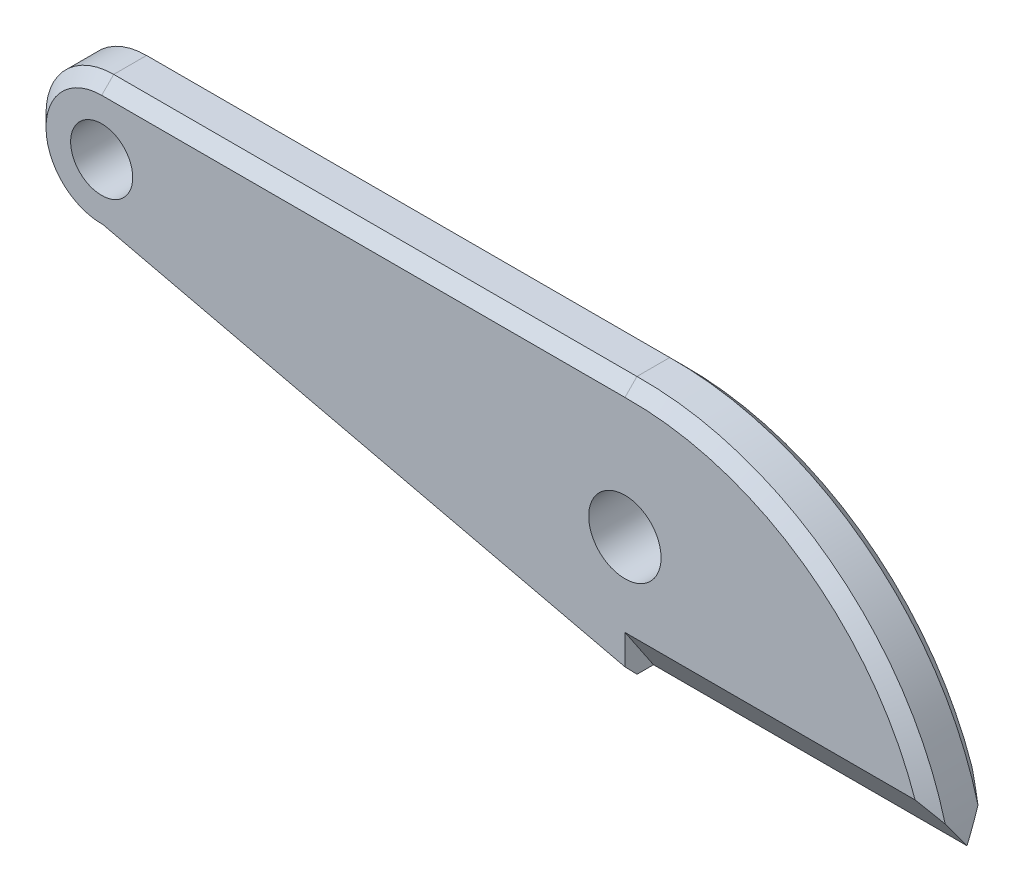
ISO-10303-21;
HEADER;
FILE_DESCRIPTION(('STEP AP214'),'2;1');
FILE_NAME('part.step','',(''),(''),'','','');
FILE_SCHEMA(('AUTOMOTIVE_DESIGN { 1 0 10303 214 1 1 1 1 }'));
ENDSEC;
DATA;
#1=APPLICATION_CONTEXT('core data for automotive mechanical design processes');
#2=APPLICATION_PROTOCOL_DEFINITION('international standard','automotive_design',2000,#1);
#3=PRODUCT_CONTEXT('',#1,'mechanical');
#4=PRODUCT('Part','Part','',(#3));
#5=PRODUCT_RELATED_PRODUCT_CATEGORY('part','',(#4));
#6=PRODUCT_DEFINITION_FORMATION('','',#4);
#7=PRODUCT_DEFINITION_CONTEXT('part definition',#1,'design');
#8=PRODUCT_DEFINITION('design','',#6,#7);
#9=PRODUCT_DEFINITION_SHAPE('','',#8);
#10=(LENGTH_UNIT() NAMED_UNIT(*) SI_UNIT(.MILLI.,.METRE.));
#11=(NAMED_UNIT(*) PLANE_ANGLE_UNIT() SI_UNIT($,.RADIAN.));
#12=(NAMED_UNIT(*) SI_UNIT($,.STERADIAN.) SOLID_ANGLE_UNIT());
#13=UNCERTAINTY_MEASURE_WITH_UNIT(LENGTH_MEASURE(1.E-05),#10,'distance_accuracy_value','');
#14=(GEOMETRIC_REPRESENTATION_CONTEXT(3) GLOBAL_UNCERTAINTY_ASSIGNED_CONTEXT((#13)) GLOBAL_UNIT_ASSIGNED_CONTEXT((#10,
#11,#12)) REPRESENTATION_CONTEXT('',''));
#15=CARTESIAN_POINT('',(0.,0.,0.));
#16=DIRECTION('',(0.,0.,1.));
#17=DIRECTION('',(1.,0.,0.));
#18=AXIS2_PLACEMENT_3D('',#15,#16,#17);
#19=CARTESIAN_POINT('',(0.,0.,9.44));
#20=DIRECTION('',(0.,0.,1.));
#21=DIRECTION('',(1.,0.,0.));
#22=AXIS2_PLACEMENT_3D('',#19,#20,#21);
#23=PLANE('',#22);
#24=CARTESIAN_POINT('',(0.,0.,9.44));
#25=DIRECTION('',(0.,0.,1.));
#26=DIRECTION('',(1.,0.,0.));
#27=AXIS2_PLACEMENT_3D('',#24,#25,#26);
#28=CIRCLE('',#27,5.15);
#29=CARTESIAN_POINT('',(5.15,0.,9.44));
#30=VERTEX_POINT('',#29);
#31=EDGE_CURVE('E214',#30,#30,#28,.T.);
#32=ORIENTED_EDGE('',*,*,#31,.F.);
#33=EDGE_LOOP('',(#32));
#34=FACE_BOUND('',#33,.T.);
#35=CARTESIAN_POINT('',(86.74,-10.81,9.44));
#36=DIRECTION('',(0.,0.,1.));
#37=DIRECTION('',(1.,0.,0.));
#38=AXIS2_PLACEMENT_3D('',#35,#36,#37);
#39=CIRCLE('',#38,6.);
#40=CARTESIAN_POINT('',(92.74,-10.81,9.44));
#41=VERTEX_POINT('',#40);
#42=EDGE_CURVE('E206',#41,#41,#39,.T.);
#43=ORIENTED_EDGE('',*,*,#42,.F.);
#44=EDGE_LOOP('',(#43));
#45=FACE_BOUND('',#44,.T.);
#46=DIRECTION('',(-1.,0.,0.));
#47=VECTOR('',#46,1.);
#48=CARTESIAN_POINT('',(0.,9.23,9.44));
#49=LINE('',#48,#47);
#50=CARTESIAN_POINT('',(86.7561179139094,9.23,9.44));
#51=VERTEX_POINT('',#50);
#52=CARTESIAN_POINT('',(0.,9.23,9.44));
#53=VERTEX_POINT('',#52);
#54=EDGE_CURVE('E264',#51,#53,#49,.T.);
#55=ORIENTED_EDGE('',*,*,#54,.T.);
#56=CARTESIAN_POINT('',(0.,0.,9.44));
#57=DIRECTION('',(0.,0.,1.));
#58=DIRECTION('',(1.,0.,0.));
#59=AXIS2_PLACEMENT_3D('',#56,#57,#58);
#60=CIRCLE('',#59,9.22999999999999);
#61=CARTESIAN_POINT('',(0.219524262516146,-9.22738907265575,9.44));
#62=VERTEX_POINT('',#61);
#63=EDGE_CURVE('E332',#53,#62,#60,.T.);
#64=ORIENTED_EDGE('',*,*,#63,.T.);
#65=DIRECTION('',(0.97374009165699,-0.227662543910581,0.));
#66=VECTOR('',#65,1.);
#67=CARTESIAN_POINT('',(87.1953250878212,-29.562519816686,9.44));
#68=LINE('',#67,#66);
#69=CARTESIAN_POINT('',(86.7699401656885,-29.4630638999135,9.44));
#70=VERTEX_POINT('',#69);
#71=EDGE_CURVE('E77',#62,#70,#68,.T.);
#72=ORIENTED_EDGE('',*,*,#71,.T.);
#73=DIRECTION('',(0.,1.,0.));
#74=VECTOR('',#73,1.);
#75=CARTESIAN_POINT('',(86.7699401656885,0.,9.44));
#76=LINE('',#75,#74);
#77=CARTESIAN_POINT('',(86.7699401656885,-24.51,9.44));
#78=VERTEX_POINT('',#77);
#79=EDGE_CURVE('E149',#70,#78,#76,.T.);
#80=ORIENTED_EDGE('',*,*,#79,.T.);
#81=DIRECTION('',(1.,0.,0.));
#82=VECTOR('',#81,1.);
#83=CARTESIAN_POINT('',(86.7699401656885,-24.51,9.44));
#84=LINE('',#83,#82);
#85=CARTESIAN_POINT('',(134.854480477729,-24.51,9.44));
#86=VERTEX_POINT('',#85);
#87=EDGE_CURVE('E153',#78,#86,#84,.T.);
#88=ORIENTED_EDGE('',*,*,#87,.T.);
#89=CARTESIAN_POINT('',(87.5699401656885,-40.7633764947169,9.44));
#90=DIRECTION('',(0.,0.,1.));
#91=DIRECTION('',(1.,0.,0.));
#92=AXIS2_PLACEMENT_3D('',#89,#90,#91);
#93=CIRCLE('',#92,50.);
#94=EDGE_CURVE('E267',#86,#51,#93,.T.);
#95=ORIENTED_EDGE('',*,*,#94,.T.);
#96=EDGE_LOOP('',(#55,#64,#72,#80,#88,#95));
#97=FACE_BOUND('',#96,.T.);
#98=ADVANCED_FACE('F47',(#34,#45,#97),#23,.T.);
#99=CARTESIAN_POINT('',(138.74,-31.51,9.44));
#100=DIRECTION('',(0.,1.,0.));
#101=DIRECTION('',(-1.,0.,0.));
#102=AXIS2_PLACEMENT_3D('',#99,#100,#101);
#103=PLANE('',#102);
#104=DIRECTION('',(0.,0.,-1.));
#105=VECTOR('',#104,1.);
#106=CARTESIAN_POINT('',(86.74,-31.51,9.44));
#107=LINE('',#106,#105);
#108=CARTESIAN_POINT('',(86.74,-31.51,7.44));
#109=VERTEX_POINT('',#108);
#110=CARTESIAN_POINT('',(86.74,-31.51,2.00000000000003));
#111=VERTEX_POINT('',#110);
#112=EDGE_CURVE('E229',#109,#111,#107,.T.);
#113=ORIENTED_EDGE('',*,*,#112,.T.);
#114=DIRECTION('',(-0.975050647346864,0.,0.221982510816644));
#115=VECTOR('',#114,1.);
#116=CARTESIAN_POINT('',(86.74,-31.51,2.00000000000003));
#117=LINE('',#116,#115);
#118=CARTESIAN_POINT('',(86.7699401656885,-31.51,1.99318374571431));
#119=VERTEX_POINT('',#118);
#120=EDGE_CURVE('E340',#111,#119,#117,.F.);
#121=ORIENTED_EDGE('',*,*,#120,.T.);
#122=DIRECTION('',(0.,0.,-1.));
#123=VECTOR('',#122,1.);
#124=CARTESIAN_POINT('',(86.7699401656885,-31.51,0.));
#125=LINE('',#124,#123);
#126=CARTESIAN_POINT('',(86.7699401656885,-31.51,4.72));
#127=VERTEX_POINT('',#126);
#128=EDGE_CURVE('E194',#127,#119,#125,.T.);
#129=ORIENTED_EDGE('',*,*,#128,.F.);
#130=DIRECTION('',(0.,0.,1.));
#131=VECTOR('',#130,1.);
#132=CARTESIAN_POINT('',(86.7699401656885,-31.51,0.));
#133=LINE('',#132,#131);
#134=CARTESIAN_POINT('',(86.7699401656885,-31.51,7.44681625428573));
#135=VERTEX_POINT('',#134);
#136=EDGE_CURVE('E159',#127,#135,#133,.T.);
#137=ORIENTED_EDGE('',*,*,#136,.T.);
#138=DIRECTION('',(-0.975050647346864,0.,-0.221982510816645));
#139=VECTOR('',#138,1.);
#140=CARTESIAN_POINT('',(2.77315825911884,-31.51,-11.6761047948661));
#141=LINE('',#140,#139);
#142=EDGE_CURVE('E343',#135,#109,#141,.T.);
#143=ORIENTED_EDGE('',*,*,#142,.T.);
#144=EDGE_LOOP('',(#113,#121,#129,#137,#143));
#145=FACE_BOUND('',#144,.T.);
#146=ADVANCED_FACE('F488',(#145),#103,.F.);
#147=CARTESIAN_POINT('',(87.5699401656885,-40.7633764947169,9.44));
#148=DIRECTION('',(0.,0.,-1.));
#149=DIRECTION('',(-1.,0.,0.));
#150=AXIS2_PLACEMENT_3D('',#147,#148,#149);
#151=CYLINDRICAL_SURFACE('',#150,52.);
#152=CARTESIAN_POINT('',(87.5699401656885,-40.7633764947169,10.9594195792948));
#153=DIRECTION('',(0.,0.559065930846162,0.829123202526087));
#154=DIRECTION('',(0.,0.829123202526087,-0.559065930846162));
#155=AXIS2_PLACEMENT_3D('',#152,#153,#154);
#156=ELLIPSE('',#155,62.716855398054,52.);
#157=CARTESIAN_POINT('',(138.74,-31.51,4.72));
#158=VERTEX_POINT('',#157);
#159=CARTESIAN_POINT('',(137.84367414671,-27.4761016949153,2.));
#160=VERTEX_POINT('',#159);
#161=EDGE_CURVE('E237',#158,#160,#156,.T.);
#162=ORIENTED_EDGE('',*,*,#161,.T.);
#163=CARTESIAN_POINT('',(87.5699401656885,-40.7633764947169,1.99999999999997));
#164=DIRECTION('',(0.,0.,1.));
#165=DIRECTION('',(1.,0.,0.));
#166=AXIS2_PLACEMENT_3D('',#163,#164,#165);
#167=CIRCLE('',#166,52.);
#168=CARTESIAN_POINT('',(86.7400000000001,11.23,1.99999999999997));
#169=VERTEX_POINT('',#168);
#170=EDGE_CURVE('E244',#160,#169,#167,.T.);
#171=ORIENTED_EDGE('',*,*,#170,.T.);
#172=DIRECTION('',(0.,0.,-1.));
#173=VECTOR('',#172,1.);
#174=CARTESIAN_POINT('',(86.7400000000001,11.23,9.44));
#175=LINE('',#174,#173);
#176=CARTESIAN_POINT('',(86.7400000000001,11.23,7.44));
#177=VERTEX_POINT('',#176);
#178=EDGE_CURVE('E225',#177,#169,#175,.T.);
#179=ORIENTED_EDGE('',*,*,#178,.F.);
#180=CARTESIAN_POINT('',(87.5699401656885,-40.7633764947169,7.44));
#181=DIRECTION('',(0.,0.,1.));
#182=DIRECTION('',(1.,0.,0.));
#183=AXIS2_PLACEMENT_3D('',#180,#181,#182);
#184=CIRCLE('',#183,52.);
#185=CARTESIAN_POINT('',(137.84367414671,-27.4761016949153,7.44));
#186=VERTEX_POINT('',#185);
#187=EDGE_CURVE('E241',#177,#186,#184,.F.);
#188=ORIENTED_EDGE('',*,*,#187,.T.);
#189=CARTESIAN_POINT('',(87.5699401656885,-40.7633764947169,-1.5194195792948));
#190=DIRECTION('',(0.,-0.559065930846162,0.829123202526087));
#191=DIRECTION('',(0.,-0.829123202526087,-0.559065930846162));
#192=AXIS2_PLACEMENT_3D('',#189,#190,#191);
#193=ELLIPSE('',#192,62.716855398054,52.);
#194=EDGE_CURVE('E169',#158,#186,#193,.T.);
#195=ORIENTED_EDGE('',*,*,#194,.F.);
#196=EDGE_LOOP('',(#162,#171,#179,#188,#195));
#197=FACE_BOUND('',#196,.T.);
#198=ADVANCED_FACE('F476',(#197),#151,.T.);
#199=CARTESIAN_POINT('',(0.,0.,0.));
#200=DIRECTION('',(0.,0.,1.));
#201=DIRECTION('',(1.,0.,0.));
#202=AXIS2_PLACEMENT_3D('',#199,#200,#201);
#203=PLANE('',#202);
#204=DIRECTION('',(-0.97374009165699,0.227662543910581,0.));
#205=VECTOR('',#204,1.);
#206=CARTESIAN_POINT('',(-2.03418787596279,-8.70046628999082,0.));
#207=LINE('',#206,#205);
#208=CARTESIAN_POINT('',(86.7699401656885,-29.4630638999134,0.));
#209=VERTEX_POINT('',#208);
#210=CARTESIAN_POINT('',(0.219524262516174,-9.22738907265572,0.));
#211=VERTEX_POINT('',#210);
#212=EDGE_CURVE('E358',#209,#211,#207,.T.);
#213=ORIENTED_EDGE('',*,*,#212,.T.);
#214=CARTESIAN_POINT('',(0.,0.,0.));
#215=DIRECTION('',(0.,0.,1.));
#216=DIRECTION('',(1.,0.,0.));
#217=AXIS2_PLACEMENT_3D('',#214,#215,#216);
#218=CIRCLE('',#217,9.22999999999996);
#219=CARTESIAN_POINT('',(0.,9.23,0.));
#220=VERTEX_POINT('',#219);
#221=EDGE_CURVE('E355',#211,#220,#218,.F.);
#222=ORIENTED_EDGE('',*,*,#221,.T.);
#223=DIRECTION('',(1.,0.,0.));
#224=VECTOR('',#223,1.);
#225=CARTESIAN_POINT('',(0.,9.23,0.));
#226=LINE('',#225,#224);
#227=CARTESIAN_POINT('',(86.7561179139092,9.22999999999999,0.));
#228=VERTEX_POINT('',#227);
#229=EDGE_CURVE('E248',#220,#228,#226,.T.);
#230=ORIENTED_EDGE('',*,*,#229,.T.);
#231=CARTESIAN_POINT('',(87.5699401656885,-40.7633764947169,0.));
#232=DIRECTION('',(0.,0.,1.));
#233=DIRECTION('',(1.,0.,0.));
#234=AXIS2_PLACEMENT_3D('',#231,#232,#233);
#235=CIRCLE('',#234,50.);
#236=CARTESIAN_POINT('',(134.854480477729,-24.51,0.));
#237=VERTEX_POINT('',#236);
#238=EDGE_CURVE('E251',#228,#237,#235,.F.);
#239=ORIENTED_EDGE('',*,*,#238,.T.);
#240=DIRECTION('',(1.,0.,0.));
#241=VECTOR('',#240,1.);
#242=CARTESIAN_POINT('',(86.7699401656885,-24.51,0.));
#243=LINE('',#242,#241);
#244=CARTESIAN_POINT('',(86.7699401656885,-24.51,0.));
#245=VERTEX_POINT('',#244);
#246=EDGE_CURVE('E198',#245,#237,#243,.T.);
#247=ORIENTED_EDGE('',*,*,#246,.F.);
#248=DIRECTION('',(0.,1.,0.));
#249=VECTOR('',#248,1.);
#250=CARTESIAN_POINT('',(86.7699401656885,0.,0.));
#251=LINE('',#250,#249);
#252=EDGE_CURVE('E187',#209,#245,#251,.T.);
#253=ORIENTED_EDGE('',*,*,#252,.F.);
#254=EDGE_LOOP('',(#213,#222,#230,#239,#247,#253));
#255=FACE_BOUND('',#254,.T.);
#256=CARTESIAN_POINT('',(0.,0.,0.));
#257=DIRECTION('',(0.,0.,1.));
#258=DIRECTION('',(1.,0.,0.));
#259=AXIS2_PLACEMENT_3D('',#256,#257,#258);
#260=CIRCLE('',#259,5.15);
#261=CARTESIAN_POINT('',(5.15,0.,0.));
#262=VERTEX_POINT('',#261);
#263=EDGE_CURVE('E210',#262,#262,#260,.T.);
#264=ORIENTED_EDGE('',*,*,#263,.T.);
#265=EDGE_LOOP('',(#264));
#266=FACE_BOUND('',#265,.T.);
#267=CARTESIAN_POINT('',(86.74,-10.81,0.));
#268=DIRECTION('',(0.,0.,1.));
#269=DIRECTION('',(1.,0.,0.));
#270=AXIS2_PLACEMENT_3D('',#267,#268,#269);
#271=CIRCLE('',#270,6.);
#272=CARTESIAN_POINT('',(92.74,-10.81,0.));
#273=VERTEX_POINT('',#272);
#274=EDGE_CURVE('E202',#273,#273,#271,.T.);
#275=ORIENTED_EDGE('',*,*,#274,.T.);
#276=EDGE_LOOP('',(#275));
#277=FACE_BOUND('',#276,.T.);
#278=ADVANCED_FACE('F497',(#255,#266,#277),#203,.F.);
#279=CARTESIAN_POINT('',(0.,0.,9.44));
#280=DIRECTION('',(0.,0.,-1.));
#281=DIRECTION('',(-1.,0.,0.));
#282=AXIS2_PLACEMENT_3D('',#279,#280,#281);
#283=CYLINDRICAL_SURFACE('',#282,11.23);
#284=DIRECTION('',(0.,0.,-1.));
#285=VECTOR('',#284,1.);
#286=CARTESIAN_POINT('',(0.,11.23,9.44));
#287=LINE('',#286,#285);
#288=CARTESIAN_POINT('',(0.,11.23,7.44));
#289=VERTEX_POINT('',#288);
#290=CARTESIAN_POINT('',(0.,11.23,1.99999999999997));
#291=VERTEX_POINT('',#290);
#292=EDGE_CURVE('E218',#289,#291,#287,.T.);
#293=ORIENTED_EDGE('',*,*,#292,.T.);
#294=CARTESIAN_POINT('',(0.,0.,2.00000000000003));
#295=DIRECTION('',(0.,0.,1.));
#296=DIRECTION('',(1.,0.,0.));
#297=AXIS2_PLACEMENT_3D('',#294,#295,#296);
#298=CIRCLE('',#297,11.23);
#299=CARTESIAN_POINT('',(0.,-11.23,2.00000000000003));
#300=VERTEX_POINT('',#299);
#301=EDGE_CURVE('E361',#291,#300,#298,.T.);
#302=ORIENTED_EDGE('',*,*,#301,.T.);
#303=DIRECTION('',(0.,0.,-1.));
#304=VECTOR('',#303,1.);
#305=CARTESIAN_POINT('',(0.,-11.23,9.44));
#306=LINE('',#305,#304);
#307=CARTESIAN_POINT('',(0.,-11.23,7.44));
#308=VERTEX_POINT('',#307);
#309=EDGE_CURVE('E233',#308,#300,#306,.T.);
#310=ORIENTED_EDGE('',*,*,#309,.F.);
#311=CARTESIAN_POINT('',(0.,0.,7.43999999999997));
#312=DIRECTION('',(0.,0.,1.));
#313=DIRECTION('',(1.,0.,0.));
#314=AXIS2_PLACEMENT_3D('',#311,#312,#313);
#315=CIRCLE('',#314,11.23);
#316=EDGE_CURVE('E271',#308,#289,#315,.F.);
#317=ORIENTED_EDGE('',*,*,#316,.T.);
#318=EDGE_LOOP('',(#293,#302,#310,#317));
#319=FACE_BOUND('',#318,.T.);
#320=ADVANCED_FACE('F370',(#319),#283,.T.);
#321=CARTESIAN_POINT('',(86.74,-31.51,9.44));
#322=DIRECTION('',(0.227662543910581,0.97374009165699,0.));
#323=DIRECTION('',(-0.97374009165699,0.227662543910581,0.));
#324=AXIS2_PLACEMENT_3D('',#321,#322,#323);
#325=PLANE('',#324);
#326=ORIENTED_EDGE('',*,*,#309,.T.);
#327=DIRECTION('',(0.97374009165699,-0.227662543910581,0.));
#328=VECTOR('',#327,1.);
#329=CARTESIAN_POINT('',(86.74,-31.51,2.00000000000003));
#330=LINE('',#329,#328);
#331=EDGE_CURVE('E346',#300,#111,#330,.T.);
#332=ORIENTED_EDGE('',*,*,#331,.T.);
#333=ORIENTED_EDGE('',*,*,#112,.F.);
#334=DIRECTION('',(-0.97374009165699,0.227662543910581,0.));
#335=VECTOR('',#334,1.);
#336=CARTESIAN_POINT('',(0.,-11.23,7.44));
#337=LINE('',#336,#335);
#338=EDGE_CURVE('E349',#109,#308,#337,.T.);
#339=ORIENTED_EDGE('',*,*,#338,.T.);
#340=EDGE_LOOP('',(#326,#332,#333,#339));
#341=FACE_BOUND('',#340,.T.);
#342=ADVANCED_FACE('F508',(#341),#325,.F.);
#343=CARTESIAN_POINT('',(0.,11.23,9.44));
#344=DIRECTION('',(0.,-1.,0.));
#345=DIRECTION('',(1.,0.,0.));
#346=AXIS2_PLACEMENT_3D('',#343,#344,#345);
#347=PLANE('',#346);
#348=ORIENTED_EDGE('',*,*,#178,.T.);
#349=DIRECTION('',(-1.,0.,0.));
#350=VECTOR('',#349,1.);
#351=CARTESIAN_POINT('',(0.,11.23,1.99999999999997));
#352=LINE('',#351,#350);
#353=EDGE_CURVE('E260',#169,#291,#352,.T.);
#354=ORIENTED_EDGE('',*,*,#353,.T.);
#355=ORIENTED_EDGE('',*,*,#292,.F.);
#356=DIRECTION('',(1.,0.,0.));
#357=VECTOR('',#356,1.);
#358=CARTESIAN_POINT('',(86.7400000000001,11.23,7.44));
#359=LINE('',#358,#357);
#360=EDGE_CURVE('E257',#289,#177,#359,.T.);
#361=ORIENTED_EDGE('',*,*,#360,.T.);
#362=EDGE_LOOP('',(#348,#354,#355,#361));
#363=FACE_BOUND('',#362,.T.);
#364=ADVANCED_FACE('F375',(#363),#347,.F.);
#365=CARTESIAN_POINT('',(0.,0.,9.44));
#366=DIRECTION('',(0.,0.,-1.));
#367=DIRECTION('',(-1.,0.,0.));
#368=AXIS2_PLACEMENT_3D('',#365,#366,#367);
#369=CYLINDRICAL_SURFACE('',#368,5.15);
#370=ORIENTED_EDGE('',*,*,#31,.T.);
#371=EDGE_LOOP('',(#370));
#372=FACE_BOUND('',#371,.T.);
#373=ORIENTED_EDGE('',*,*,#263,.F.);
#374=EDGE_LOOP('',(#373));
#375=FACE_BOUND('',#374,.T.);
#376=ADVANCED_FACE('F526',(#372,#375),#369,.F.);
#377=CARTESIAN_POINT('',(86.74,-10.81,9.44));
#378=DIRECTION('',(0.,0.,-1.));
#379=DIRECTION('',(-1.,0.,0.));
#380=AXIS2_PLACEMENT_3D('',#377,#378,#379);
#381=CYLINDRICAL_SURFACE('',#380,6.);
#382=ORIENTED_EDGE('',*,*,#42,.T.);
#383=EDGE_LOOP('',(#382));
#384=FACE_BOUND('',#383,.T.);
#385=ORIENTED_EDGE('',*,*,#274,.F.);
#386=EDGE_LOOP('',(#385));
#387=FACE_BOUND('',#386,.T.);
#388=ADVANCED_FACE('F554',(#384,#387),#381,.F.);
#389=CARTESIAN_POINT('',(86.7699401656885,-7.66071606545604,-11.3612314530068));
#390=DIRECTION('',(0.,0.559065930846162,0.829123202526087));
#391=DIRECTION('',(0.,-0.829123202526087,0.559065930846162));
#392=AXIS2_PLACEMENT_3D('',#389,#390,#391);
#393=PLANE('',#392);
#394=ORIENTED_EDGE('',*,*,#246,.T.);
#395=CARTESIAN_POINT('',(87.5699401656885,-116.136828043275,61.7826611948938));
#396=DIRECTION('',(0.,0.559065930846162,0.829123202526087));
#397=DIRECTION('',(0.,-0.829123202526087,0.559065930846162));
#398=AXIS2_PLACEMENT_3D('',#395,#396,#397);
#399=ELLIPSE('',#398,134.820326887882,82.5482049803006);
#400=EDGE_CURVE('E254',#237,#160,#399,.F.);
#401=ORIENTED_EDGE('',*,*,#400,.T.);
#402=ORIENTED_EDGE('',*,*,#161,.F.);
#403=DIRECTION('',(1.,0.,0.));
#404=VECTOR('',#403,1.);
#405=CARTESIAN_POINT('',(86.7699401656885,-31.51,4.72));
#406=LINE('',#405,#404);
#407=EDGE_CURVE('E199',#127,#158,#406,.T.);
#408=ORIENTED_EDGE('',*,*,#407,.F.);
#409=DIRECTION('',(0.,-0.829123202526087,0.559065930846162));
#410=VECTOR('',#409,1.);
#411=CARTESIAN_POINT('',(86.7699401656885,-7.66071606545604,-11.3612314530068));
#412=LINE('',#411,#410);
#413=EDGE_CURVE('E190',#245,#127,#412,.T.);
#414=ORIENTED_EDGE('',*,*,#413,.F.);
#415=EDGE_LOOP('',(#394,#401,#402,#408,#414));
#416=FACE_BOUND('',#415,.T.);
#417=ADVANCED_FACE('F480',(#416),#393,.F.);
#418=CARTESIAN_POINT('',(86.7699401656885,0.,0.));
#419=DIRECTION('',(1.,0.,0.));
#420=DIRECTION('',(0.,0.,-1.));
#421=AXIS2_PLACEMENT_3D('',#418,#419,#420);
#422=PLANE('',#421);
#423=ORIENTED_EDGE('',*,*,#128,.T.);
#424=DIRECTION('',(0.,-0.716451176875376,0.697637234638382));
#425=VECTOR('',#424,1.);
#426=CARTESIAN_POINT('',(86.7699401656885,-14.3396057636686,-14.7263175117575));
#427=LINE('',#426,#425);
#428=EDGE_CURVE('E337',#119,#209,#427,.F.);
#429=ORIENTED_EDGE('',*,*,#428,.T.);
#430=ORIENTED_EDGE('',*,*,#252,.T.);
#431=ORIENTED_EDGE('',*,*,#413,.T.);
#432=EDGE_LOOP('',(#423,#429,#430,#431));
#433=FACE_BOUND('',#432,.T.);
#434=ADVANCED_FACE('F484',(#433),#422,.T.);
#435=CARTESIAN_POINT('',(86.7699401656885,-12.0364820759164,17.8507149430964));
#436=DIRECTION('',(0.,-0.559065930846162,0.829123202526087));
#437=DIRECTION('',(0.,-0.829123202526087,-0.559065930846162));
#438=AXIS2_PLACEMENT_3D('',#435,#436,#437);
#439=PLANE('',#438);
#440=ORIENTED_EDGE('',*,*,#194,.T.);
#441=CARTESIAN_POINT('',(87.5699401656885,-116.136828043272,-52.3426611948918));
#442=DIRECTION('',(0.,-0.559065930846162,0.829123202526087));
#443=DIRECTION('',(0.,-0.829123202526087,-0.559065930846162));
#444=AXIS2_PLACEMENT_3D('',#441,#442,#443);
#445=ELLIPSE('',#444,134.820326887878,82.5482049802995);
#446=EDGE_CURVE('E167',#186,#86,#445,.T.);
#447=ORIENTED_EDGE('',*,*,#446,.T.);
#448=ORIENTED_EDGE('',*,*,#87,.F.);
#449=DIRECTION('',(0.,-0.829123202526087,-0.559065930846162));
#450=VECTOR('',#449,1.);
#451=CARTESIAN_POINT('',(86.7699401656885,-12.0364820759164,17.8507149430964));
#452=LINE('',#451,#450);
#453=EDGE_CURVE('E160',#78,#127,#452,.T.);
#454=ORIENTED_EDGE('',*,*,#453,.T.);
#455=ORIENTED_EDGE('',*,*,#407,.T.);
#456=EDGE_LOOP('',(#440,#447,#448,#454,#455));
#457=FACE_BOUND('',#456,.T.);
#458=ADVANCED_FACE('F164',(#457),#439,.T.);
#459=CARTESIAN_POINT('',(86.7699401656885,0.,0.));
#460=DIRECTION('',(1.,0.,0.));
#461=DIRECTION('',(0.,0.,-1.));
#462=AXIS2_PLACEMENT_3D('',#459,#460,#461);
#463=PLANE('',#462);
#464=ORIENTED_EDGE('',*,*,#79,.F.);
#465=DIRECTION('',(0.,-0.716451176875374,-0.697637234638384));
#466=VECTOR('',#465,1.);
#467=CARTESIAN_POINT('',(86.7699401656885,-19.0579350515946,19.5718911184648));
#468=LINE('',#467,#466);
#469=EDGE_CURVE('E11',#70,#135,#468,.T.);
#470=ORIENTED_EDGE('',*,*,#469,.T.);
#471=ORIENTED_EDGE('',*,*,#136,.F.);
#472=ORIENTED_EDGE('',*,*,#453,.F.);
#473=EDGE_LOOP('',(#464,#470,#471,#472));
#474=FACE_BOUND('',#473,.T.);
#475=ADVANCED_FACE('F171',(#474),#463,.T.);
#476=CARTESIAN_POINT('',(0.,11.23,1.99999999999997));
#477=DIRECTION('',(0.,-0.707106781186545,0.70710678118655));
#478=DIRECTION('',(-1.,0.,0.));
#479=AXIS2_PLACEMENT_3D('',#476,#477,#478);
#480=PLANE('',#479);
#481=ORIENTED_EDGE('',*,*,#229,.F.);
#482=DIRECTION('',(0.,0.70710678118655,0.707106781186545));
#483=VECTOR('',#482,1.);
#484=CARTESIAN_POINT('',(0.,5.61499999999997,-3.61499999999998));
#485=LINE('',#484,#483);
#486=EDGE_CURVE('E352',#220,#291,#485,.T.);
#487=ORIENTED_EDGE('',*,*,#486,.T.);
#488=ORIENTED_EDGE('',*,*,#353,.F.);
#489=CARTESIAN_POINT('',(86.74,11.23,1.99999999999997));
#490=CARTESIAN_POINT('',(86.7426599791371,10.8966665605359,1.6666665605359));
#491=CARTESIAN_POINT('',(86.7453331281981,10.5633331741398,1.33333317413975));
#492=CARTESIAN_POINT('',(86.7507057661679,9.89666650747309,0.66666650747309));
#493=CARTESIAN_POINT('',(86.7534052550767,9.56333322720259,0.333333227202584));
#494=CARTESIAN_POINT('',(86.7561179139094,9.23,0.));
#495=B_SPLINE_CURVE_WITH_KNOTS('',3,(#489,#490,#491,#492,#493,#494),.UNSPECIFIED.,.F.,.F.,(4,2,
4),(0.,1.41423652487377,2.82847304979082),.UNSPECIFIED.);
#496=EDGE_CURVE('E175',#228,#169,#495,.F.);
#497=ORIENTED_EDGE('',*,*,#496,.F.);
#498=EDGE_LOOP('',(#481,#487,#488,#497));
#499=FACE_BOUND('',#498,.T.);
#500=ADVANCED_FACE('F291',(#499),#480,.F.);
#501=CARTESIAN_POINT('',(87.5699401656885,-40.7633764947169,1.99999999999997));
#502=DIRECTION('',(0.,0.,1.));
#503=DIRECTION('',(1.,0.,0.));
#504=AXIS2_PLACEMENT_3D('',#501,#502,#503);
#505=CONICAL_SURFACE('',#504,52.,0.785398163397452);
#506=ORIENTED_EDGE('',*,*,#400,.F.);
#507=ORIENTED_EDGE('',*,*,#238,.F.);
#508=ORIENTED_EDGE('',*,*,#496,.T.);
#509=ORIENTED_EDGE('',*,*,#170,.F.);
#510=EDGE_LOOP('',(#506,#507,#508,#509));
#511=FACE_BOUND('',#510,.T.);
#512=ADVANCED_FACE('F287',(#511),#505,.T.);
#513=CARTESIAN_POINT('',(0.,9.23,9.44));
#514=DIRECTION('',(0.,0.70710678118655,0.707106781186545));
#515=DIRECTION('',(1.,0.,0.));
#516=AXIS2_PLACEMENT_3D('',#513,#514,#515);
#517=PLANE('',#516);
#518=ORIENTED_EDGE('',*,*,#360,.F.);
#519=DIRECTION('',(0.,0.707106781186545,-0.70710678118655));
#520=VECTOR('',#519,1.);
#521=CARTESIAN_POINT('',(0.,4.61500000000002,14.055));
#522=LINE('',#521,#520);
#523=EDGE_CURVE('E63',#289,#53,#522,.F.);
#524=ORIENTED_EDGE('',*,*,#523,.T.);
#525=ORIENTED_EDGE('',*,*,#54,.F.);
#526=CARTESIAN_POINT('',(86.7561179139094,9.23,9.44));
#527=CARTESIAN_POINT('',(86.7534052550767,9.56333322720259,9.10666677279742));
#528=CARTESIAN_POINT('',(86.7507057661679,9.89666650747309,8.7733334925269));
#529=CARTESIAN_POINT('',(86.7453331281981,10.5633331741398,8.10666682586024));
#530=CARTESIAN_POINT('',(86.742659979137,10.8966665605359,7.77333343946408));
#531=CARTESIAN_POINT('',(86.7399999999999,11.23,7.44));
#532=B_SPLINE_CURVE_WITH_KNOTS('',3,(#526,#527,#528,#529,#530,#531),.UNSPECIFIED.,.F.,.F.,(4,2,
4),(0.,1.41423652491706,2.82847304979084),.UNSPECIFIED.);
#533=EDGE_CURVE('E180',#177,#51,#532,.F.);
#534=ORIENTED_EDGE('',*,*,#533,.F.);
#535=EDGE_LOOP('',(#518,#524,#525,#534));
#536=FACE_BOUND('',#535,.T.);
#537=ADVANCED_FACE('F305',(#536),#517,.T.);
#538=CARTESIAN_POINT('',(87.5699401656885,-40.7633764947169,9.44));
#539=DIRECTION('',(0.,0.,-1.));
#540=DIRECTION('',(-1.,0.,0.));
#541=AXIS2_PLACEMENT_3D('',#538,#539,#540);
#542=CONICAL_SURFACE('',#541,50.,0.785398163397445);
#543=ORIENTED_EDGE('',*,*,#446,.F.);
#544=ORIENTED_EDGE('',*,*,#187,.F.);
#545=ORIENTED_EDGE('',*,*,#533,.T.);
#546=ORIENTED_EDGE('',*,*,#94,.F.);
#547=EDGE_LOOP('',(#543,#544,#545,#546));
#548=FACE_BOUND('',#547,.T.);
#549=ADVANCED_FACE('F298',(#548),#542,.T.);
#550=CARTESIAN_POINT('',(86.74,-31.51,2.00000000000003));
#551=DIRECTION('',(0.160981728621351,0.688538221923865,0.70710678118655));
#552=DIRECTION('',(0.97374009165699,-0.227662543910581,0.));
#553=AXIS2_PLACEMENT_3D('',#550,#551,#552);
#554=PLANE('',#553);
#555=ORIENTED_EDGE('',*,*,#120,.F.);
#556=ORIENTED_EDGE('',*,*,#331,.F.);
#557=CARTESIAN_POINT('',(0.,-11.23,2.00000000000003));
#558=CARTESIAN_POINT('',(0.0385531346672527,-10.8965674982997,1.66654630051886));
#559=CARTESIAN_POINT('',(0.0761233829933072,-10.5629670763684,1.33315285678145));
#560=CARTESIAN_POINT('',(0.149298138880206,-9.89543010087996,0.666486190009646));
#561=CARTESIAN_POINT('',(0.184902644726201,-9.56149354702977,0.333212967080374));
#562=CARTESIAN_POINT('',(0.219524262516174,-9.22738907265572,0.));
#563=B_SPLINE_CURVE_WITH_KNOTS('',3,(#557,#558,#559,#560,#561,#562),.UNSPECIFIED.,.F.,.F.,(4,2,
4),(0.,1.41938986208571,2.83878096238183),.UNSPECIFIED.);
#564=EDGE_CURVE('E323',#211,#300,#563,.F.);
#565=ORIENTED_EDGE('',*,*,#564,.F.);
#566=ORIENTED_EDGE('',*,*,#212,.F.);
#567=ORIENTED_EDGE('',*,*,#428,.F.);
#568=EDGE_LOOP('',(#555,#556,#565,#566,#567));
#569=FACE_BOUND('',#568,.T.);
#570=ADVANCED_FACE('F304',(#569),#554,.F.);
#571=CARTESIAN_POINT('',(0.,0.,2.00000000000003));
#572=DIRECTION('',(0.,0.,1.));
#573=DIRECTION('',(1.,0.,0.));
#574=AXIS2_PLACEMENT_3D('',#571,#572,#573);
#575=CONICAL_SURFACE('',#574,11.23,0.78539816339745);
#576=ORIENTED_EDGE('',*,*,#486,.F.);
#577=ORIENTED_EDGE('',*,*,#221,.F.);
#578=ORIENTED_EDGE('',*,*,#564,.T.);
#579=ORIENTED_EDGE('',*,*,#301,.F.);
#580=EDGE_LOOP('',(#576,#577,#578,#579));
#581=FACE_BOUND('',#580,.T.);
#582=ADVANCED_FACE('F314',(#581),#575,.T.);
#583=CARTESIAN_POINT('',(-2.03418787596277,-8.70046628999085,9.44));
#584=DIRECTION('',(-0.160981728621352,-0.688538221923868,0.707106781186547));
#585=DIRECTION('',(-0.97374009165699,0.227662543910581,0.));
#586=AXIS2_PLACEMENT_3D('',#583,#584,#585);
#587=PLANE('',#586);
#588=ORIENTED_EDGE('',*,*,#469,.F.);
#589=ORIENTED_EDGE('',*,*,#71,.F.);
#590=CARTESIAN_POINT('',(0.219524262516146,-9.22738907265575,9.44));
#591=CARTESIAN_POINT('',(0.184902644726155,-9.56149354702981,9.10678703291963));
#592=CARTESIAN_POINT('',(0.149298138880152,-9.89543010087998,8.77351380999036));
#593=CARTESIAN_POINT('',(0.0761233829932531,-10.5629670763684,8.10684714321856));
#594=CARTESIAN_POINT('',(0.0385531346672074,-10.8965674982997,7.77345369948115));
#595=CARTESIAN_POINT('',(0.,-11.23,7.43999999999997));
#596=B_SPLINE_CURVE_WITH_KNOTS('',3,(#590,#591,#592,#593,#594,#595),.UNSPECIFIED.,.F.,.F.,(4,2,
4),(0.,1.41939110029611,2.8387809623818),.UNSPECIFIED.);
#597=EDGE_CURVE('E53',#308,#62,#596,.F.);
#598=ORIENTED_EDGE('',*,*,#597,.F.);
#599=ORIENTED_EDGE('',*,*,#338,.F.);
#600=ORIENTED_EDGE('',*,*,#142,.F.);
#601=EDGE_LOOP('',(#588,#589,#598,#599,#600));
#602=FACE_BOUND('',#601,.T.);
#603=ADVANCED_FACE('F50',(#602),#587,.T.);
#604=CARTESIAN_POINT('',(0.,0.,9.44));
#605=DIRECTION('',(0.,0.,-1.));
#606=DIRECTION('',(-1.,0.,0.));
#607=AXIS2_PLACEMENT_3D('',#604,#605,#606);
#608=CONICAL_SURFACE('',#607,9.22999999999999,0.785398163397447);
#609=ORIENTED_EDGE('',*,*,#523,.F.);
#610=ORIENTED_EDGE('',*,*,#316,.F.);
#611=ORIENTED_EDGE('',*,*,#597,.T.);
#612=ORIENTED_EDGE('',*,*,#63,.F.);
#613=EDGE_LOOP('',(#609,#610,#611,#612));
#614=FACE_BOUND('',#613,.T.);
#615=ADVANCED_FACE('F380',(#614),#608,.T.);
#616=CLOSED_SHELL('',(#98,#146,#198,#278,#320,#342,#364,#376,#388,#417,#434,#458,#475,#500,#512,
#537,#549,#570,#582,#603,#615));
#617=MANIFOLD_SOLID_BREP('B2',#616);
#618=ADVANCED_BREP_SHAPE_REPRESENTATION('',(#18,#617),#14);
#619=SHAPE_DEFINITION_REPRESENTATION(#9,#618);
ENDSEC;
END-ISO-10303-21;
